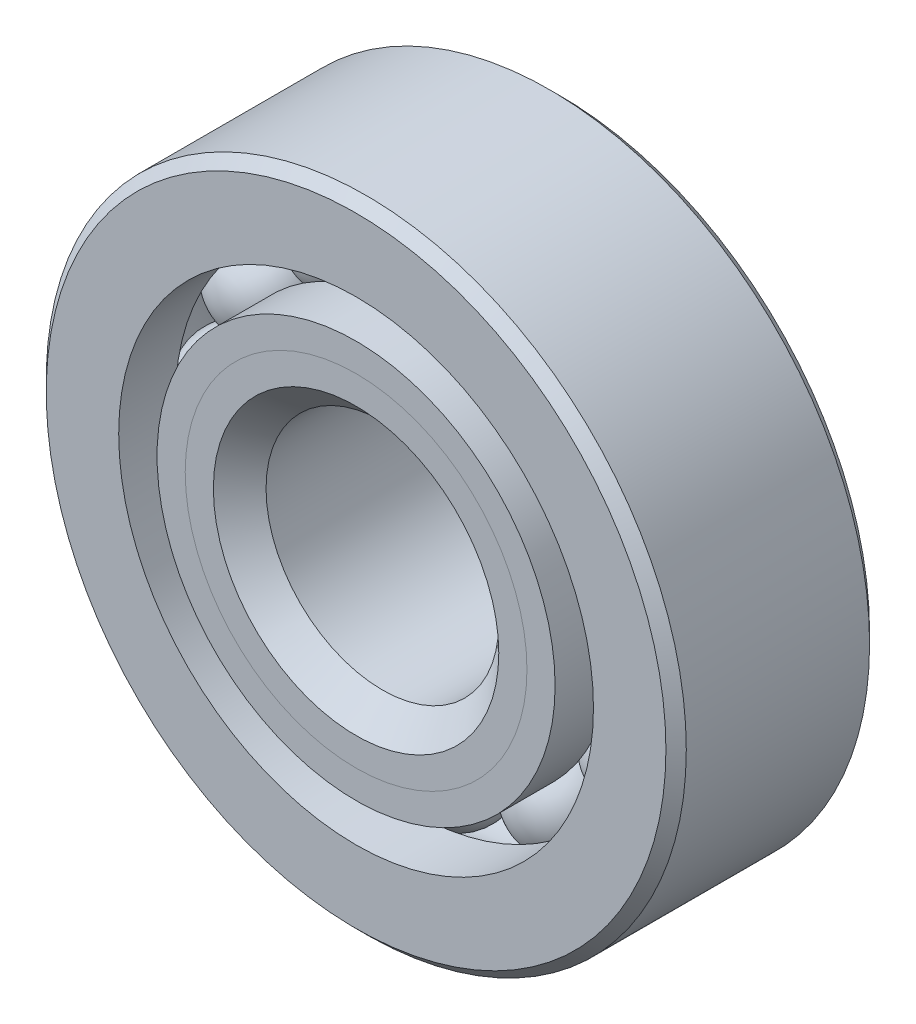
ISO-10303-21;
HEADER;
FILE_DESCRIPTION(('STEP AP214'),'2;1');
FILE_NAME('part.step','',(''),(''),'','','');
FILE_SCHEMA(('AUTOMOTIVE_DESIGN { 1 0 10303 214 1 1 1 1 }'));
ENDSEC;
DATA;
#1=APPLICATION_CONTEXT('core data for automotive mechanical design processes');
#2=APPLICATION_PROTOCOL_DEFINITION('international standard','automotive_design',2000,#1);
#3=PRODUCT_CONTEXT('',#1,'mechanical');
#4=PRODUCT('Part','Part','',(#3));
#5=PRODUCT_RELATED_PRODUCT_CATEGORY('part','',(#4));
#6=PRODUCT_DEFINITION_FORMATION('','',#4);
#7=PRODUCT_DEFINITION_CONTEXT('part definition',#1,'design');
#8=PRODUCT_DEFINITION('design','',#6,#7);
#9=PRODUCT_DEFINITION_SHAPE('','',#8);
#10=(LENGTH_UNIT() NAMED_UNIT(*) SI_UNIT(.MILLI.,.METRE.));
#11=(NAMED_UNIT(*) PLANE_ANGLE_UNIT() SI_UNIT($,.RADIAN.));
#12=(NAMED_UNIT(*) SI_UNIT($,.STERADIAN.) SOLID_ANGLE_UNIT());
#13=UNCERTAINTY_MEASURE_WITH_UNIT(LENGTH_MEASURE(1.E-05),#10,'distance_accuracy_value','');
#14=(GEOMETRIC_REPRESENTATION_CONTEXT(3) GLOBAL_UNCERTAINTY_ASSIGNED_CONTEXT((#13)) GLOBAL_UNIT_ASSIGNED_CONTEXT((#10,
#11,#12)) REPRESENTATION_CONTEXT('',''));
#15=CARTESIAN_POINT('',(0.,0.,0.));
#16=DIRECTION('',(0.,0.,1.));
#17=DIRECTION('',(1.,0.,0.));
#18=AXIS2_PLACEMENT_3D('',#15,#16,#17);
#19=CARTESIAN_POINT('',(-5.95312499999987,10.3111149638085,0.));
#20=DIRECTION('',(0.,0.,1.));
#21=DIRECTION('',(-0.499999999999989,0.866025403784445,0.));
#22=AXIS2_PLACEMENT_3D('',#19,#20,#21);
#23=SPHERICAL_SURFACE('',#22,2.68211551867683);
#24=CARTESIAN_POINT('',(-5.95312499999987,10.3111149638085,2.68211551867683));
#25=VERTEX_POINT('',#24);
#26=VERTEX_LOOP('',#25);
#27=FACE_BOUND('',#26,.T.);
#28=ADVANCED_FACE('F41',(#27),#23,.T.);
#29=CLOSED_SHELL('',(#28));
#30=MANIFOLD_SOLID_BREP('B2',#29);
#31=CARTESIAN_POINT('',(-10.3111149638084,5.95312500000012,0.));
#32=DIRECTION('',(0.,0.,1.));
#33=DIRECTION('',(-0.866025403784433,0.50000000000001,0.));
#34=AXIS2_PLACEMENT_3D('',#31,#32,#33);
#35=SPHERICAL_SURFACE('',#34,2.68211551867683);
#36=CARTESIAN_POINT('',(-10.3111149638084,5.95312500000012,2.68211551867683));
#37=VERTEX_POINT('',#36);
#38=VERTEX_LOOP('',#37);
#39=FACE_BOUND('',#38,.T.);
#40=ADVANCED_FACE('F70',(#39),#35,.T.);
#41=CLOSED_SHELL('',(#40));
#42=MANIFOLD_SOLID_BREP('B6',#41);
#43=CARTESIAN_POINT('',(-11.90625,1.24711421304626E-13,0.));
#44=DIRECTION('',(0.,0.,1.));
#45=DIRECTION('',(-1.,0.,0.));
#46=AXIS2_PLACEMENT_3D('',#43,#44,#45);
#47=SPHERICAL_SURFACE('',#46,2.68211551867683);
#48=CARTESIAN_POINT('',(-11.90625,1.24711421304626E-13,2.68211551867683));
#49=VERTEX_POINT('',#48);
#50=VERTEX_LOOP('',#49);
#51=FACE_BOUND('',#50,.T.);
#52=ADVANCED_FACE('F99',(#51),#47,.T.);
#53=CLOSED_SHELL('',(#52));
#54=MANIFOLD_SOLID_BREP('B37',#53);
#55=CARTESIAN_POINT('',(-10.3111149638085,-5.9531249999999,0.));
#56=DIRECTION('',(0.,0.,1.));
#57=DIRECTION('',(-0.866025403784443,-0.499999999999992,0.));
#58=AXIS2_PLACEMENT_3D('',#55,#56,#57);
#59=SPHERICAL_SURFACE('',#58,2.68211551867683);
#60=CARTESIAN_POINT('',(-10.3111149638085,-5.9531249999999,2.68211551867683));
#61=VERTEX_POINT('',#60);
#62=VERTEX_LOOP('',#61);
#63=FACE_BOUND('',#62,.T.);
#64=ADVANCED_FACE('F128',(#63),#59,.T.);
#65=CLOSED_SHELL('',(#64));
#66=MANIFOLD_SOLID_BREP('B66',#65);
#67=CARTESIAN_POINT('',(-5.95312500000009,-10.3111149638084,0.));
#68=DIRECTION('',(0.,0.,1.));
#69=DIRECTION('',(-0.500000000000007,-0.866025403784435,0.));
#70=AXIS2_PLACEMENT_3D('',#67,#68,#69);
#71=SPHERICAL_SURFACE('',#70,2.68211551867683);
#72=CARTESIAN_POINT('',(-5.95312500000009,-10.3111149638084,2.68211551867683));
#73=VERTEX_POINT('',#72);
#74=VERTEX_LOOP('',#73);
#75=FACE_BOUND('',#74,.T.);
#76=ADVANCED_FACE('F157',(#75),#71,.T.);
#77=CLOSED_SHELL('',(#76));
#78=MANIFOLD_SOLID_BREP('B95',#77);
#79=CARTESIAN_POINT('',(0.,-11.90625,0.));
#80=DIRECTION('',(0.,0.,1.));
#81=DIRECTION('',(0.,-1.,0.));
#82=AXIS2_PLACEMENT_3D('',#79,#80,#81);
#83=SPHERICAL_SURFACE('',#82,2.68211551867683);
#84=CARTESIAN_POINT('',(0.,-11.90625,2.68211551867683));
#85=VERTEX_POINT('',#84);
#86=VERTEX_LOOP('',#85);
#87=FACE_BOUND('',#86,.T.);
#88=ADVANCED_FACE('F186',(#87),#83,.T.);
#89=CLOSED_SHELL('',(#88));
#90=MANIFOLD_SOLID_BREP('B124',#89);
#91=CARTESIAN_POINT('',(5.95312499999994,-10.3111149638085,0.));
#92=DIRECTION('',(0.,0.,1.));
#93=DIRECTION('',(0.499999999999995,-0.866025403784442,0.));
#94=AXIS2_PLACEMENT_3D('',#91,#92,#93);
#95=SPHERICAL_SURFACE('',#94,2.68211551867683);
#96=CARTESIAN_POINT('',(5.95312499999994,-10.3111149638085,2.68211551867683));
#97=VERTEX_POINT('',#96);
#98=VERTEX_LOOP('',#97);
#99=FACE_BOUND('',#98,.T.);
#100=ADVANCED_FACE('F215',(#99),#95,.T.);
#101=CLOSED_SHELL('',(#100));
#102=MANIFOLD_SOLID_BREP('B153',#101);
#103=CARTESIAN_POINT('',(10.3111149638084,-5.95312500000005,0.));
#104=DIRECTION('',(0.,0.,1.));
#105=DIRECTION('',(0.866025403784436,-0.500000000000004,0.));
#106=AXIS2_PLACEMENT_3D('',#103,#104,#105);
#107=SPHERICAL_SURFACE('',#106,2.68211551867683);
#108=CARTESIAN_POINT('',(10.3111149638084,-5.95312500000005,2.68211551867683));
#109=VERTEX_POINT('',#108);
#110=VERTEX_LOOP('',#109);
#111=FACE_BOUND('',#110,.T.);
#112=ADVANCED_FACE('F244',(#111),#107,.T.);
#113=CLOSED_SHELL('',(#112));
#114=MANIFOLD_SOLID_BREP('B182',#113);
#115=CARTESIAN_POINT('',(11.90625,0.,0.));
#116=DIRECTION('',(0.,0.,1.));
#117=DIRECTION('',(1.,0.,0.));
#118=AXIS2_PLACEMENT_3D('',#115,#116,#117);
#119=SPHERICAL_SURFACE('',#118,2.68211551867683);
#120=CARTESIAN_POINT('',(11.90625,0.,2.68211551867683));
#121=VERTEX_POINT('',#120);
#122=VERTEX_LOOP('',#121);
#123=FACE_BOUND('',#122,.T.);
#124=ADVANCED_FACE('F273',(#123),#119,.T.);
#125=CLOSED_SHELL('',(#124));
#126=MANIFOLD_SOLID_BREP('B211',#125);
#127=CARTESIAN_POINT('',(10.3111149638085,5.95312499999998,0.));
#128=DIRECTION('',(0.,0.,1.));
#129=DIRECTION('',(0.86602540378444,0.499999999999998,0.));
#130=AXIS2_PLACEMENT_3D('',#127,#128,#129);
#131=SPHERICAL_SURFACE('',#130,2.68211551867683);
#132=CARTESIAN_POINT('',(10.3111149638085,5.95312499999998,2.68211551867683));
#133=VERTEX_POINT('',#132);
#134=VERTEX_LOOP('',#133);
#135=FACE_BOUND('',#134,.T.);
#136=ADVANCED_FACE('F302',(#135),#131,.T.);
#137=CLOSED_SHELL('',(#136));
#138=MANIFOLD_SOLID_BREP('B240',#137);
#139=CARTESIAN_POINT('',(5.95312500000001,10.3111149638085,0.));
#140=DIRECTION('',(0.,0.,1.));
#141=DIRECTION('',(0.500000000000001,0.866025403784438,0.));
#142=AXIS2_PLACEMENT_3D('',#139,#140,#141);
#143=SPHERICAL_SURFACE('',#142,2.68211551867683);
#144=CARTESIAN_POINT('',(5.95312500000001,10.3111149638085,2.68211551867683));
#145=VERTEX_POINT('',#144);
#146=VERTEX_LOOP('',#145);
#147=FACE_BOUND('',#146,.T.);
#148=ADVANCED_FACE('F331',(#147),#143,.T.);
#149=CLOSED_SHELL('',(#148));
#150=MANIFOLD_SOLID_BREP('B269',#149);
#151=CARTESIAN_POINT('',(0.,11.90625,0.));
#152=DIRECTION('',(0.,0.,1.));
#153=DIRECTION('',(0.,1.,0.));
#154=AXIS2_PLACEMENT_3D('',#151,#152,#153);
#155=SPHERICAL_SURFACE('',#154,2.68211551867683);
#156=CARTESIAN_POINT('',(0.,11.90625,2.68211551867683));
#157=VERTEX_POINT('',#156);
#158=VERTEX_LOOP('',#157);
#159=FACE_BOUND('',#158,.T.);
#160=ADVANCED_FACE('F362',(#159),#155,.T.);
#161=CLOSED_SHELL('',(#160));
#162=MANIFOLD_SOLID_BREP('B298',#161);
#163=CARTESIAN_POINT('',(0.,9.32330697197915,5.55625));
#164=DIRECTION('',(0.,0.,-1.));
#165=DIRECTION('',(-1.,0.,0.));
#166=AXIS2_PLACEMENT_3D('',#163,#164,#165);
#167=PLANE('',#166);
#168=CARTESIAN_POINT('',(0.,0.,5.55625));
#169=DIRECTION('',(0.,0.,1.));
#170=DIRECTION('',(1.,0.,0.));
#171=AXIS2_PLACEMENT_3D('',#168,#169,#170);
#172=CIRCLE('',#171,7.78706724066159);
#173=CARTESIAN_POINT('',(7.78706724066159,0.,5.55625));
#174=VERTEX_POINT('',#173);
#175=EDGE_CURVE('E416',#174,#174,#172,.T.);
#176=ORIENTED_EDGE('',*,*,#175,.F.);
#177=EDGE_LOOP('',(#176));
#178=FACE_BOUND('',#177,.T.);
#179=CARTESIAN_POINT('',(0.,0.,5.55625));
#180=DIRECTION('',(0.,0.,1.));
#181=DIRECTION('',(1.,0.,0.));
#182=AXIS2_PLACEMENT_3D('',#179,#180,#181);
#183=CIRCLE('',#182,9.32330697197915);
#184=CARTESIAN_POINT('',(9.32330697197915,0.,5.55625));
#185=VERTEX_POINT('',#184);
#186=EDGE_CURVE('E361',#185,#185,#183,.T.);
#187=ORIENTED_EDGE('',*,*,#186,.T.);
#188=EDGE_LOOP('',(#187));
#189=FACE_BOUND('',#188,.T.);
#190=ADVANCED_FACE('F382',(#178,#189),#167,.F.);
#191=CARTESIAN_POINT('',(0.,0.,4.02001026868245));
#192=DIRECTION('',(0.,0.,1.));
#193=DIRECTION('',(1.,0.,0.));
#194=AXIS2_PLACEMENT_3D('',#191,#192,#193);
#195=CONICAL_SURFACE('',#194,7.78706724066159,0.785398163397451);
#196=ORIENTED_EDGE('',*,*,#186,.F.);
#197=EDGE_LOOP('',(#196));
#198=FACE_BOUND('',#197,.T.);
#199=CARTESIAN_POINT('',(0.,0.,4.02001026868245));
#200=DIRECTION('',(0.,0.,1.));
#201=DIRECTION('',(1.,0.,0.));
#202=AXIS2_PLACEMENT_3D('',#199,#200,#201);
#203=CIRCLE('',#202,7.78706724066159);
#204=CARTESIAN_POINT('',(7.78706724066159,0.,4.02001026868245));
#205=VERTEX_POINT('',#204);
#206=EDGE_CURVE('E388',#205,#205,#203,.T.);
#207=ORIENTED_EDGE('',*,*,#206,.T.);
#208=EDGE_LOOP('',(#207));
#209=FACE_BOUND('',#208,.T.);
#210=ADVANCED_FACE('F423',(#198,#209),#195,.T.);
#211=CARTESIAN_POINT('',(0.,0.,5.55625));
#212=DIRECTION('',(0.,0.,1.));
#213=DIRECTION('',(1.,0.,0.));
#214=AXIS2_PLACEMENT_3D('',#211,#212,#213);
#215=CYLINDRICAL_SURFACE('',#214,7.78706724066159);
#216=ORIENTED_EDGE('',*,*,#206,.F.);
#217=EDGE_LOOP('',(#216));
#218=FACE_BOUND('',#217,.T.);
#219=CARTESIAN_POINT('',(0.,0.,0.));
#220=DIRECTION('',(0.,0.,1.));
#221=DIRECTION('',(1.,0.,0.));
#222=AXIS2_PLACEMENT_3D('',#219,#220,#221);
#223=CIRCLE('',#222,7.78706724066159);
#224=CARTESIAN_POINT('',(7.78706724066159,0.,0.));
#225=VERTEX_POINT('',#224);
#226=EDGE_CURVE('E392',#225,#225,#223,.T.);
#227=ORIENTED_EDGE('',*,*,#226,.T.);
#228=EDGE_LOOP('',(#227));
#229=FACE_BOUND('',#228,.T.);
#230=ADVANCED_FACE('F427',(#218,#229),#215,.T.);
#231=CARTESIAN_POINT('',(0.,7.78706724066159,0.));
#232=DIRECTION('',(0.,0.,-1.));
#233=DIRECTION('',(-1.,0.,0.));
#234=AXIS2_PLACEMENT_3D('',#231,#232,#233);
#235=PLANE('',#234);
#236=ORIENTED_EDGE('',*,*,#226,.F.);
#237=EDGE_LOOP('',(#236));
#238=FACE_BOUND('',#237,.T.);
#239=CARTESIAN_POINT('',(0.,0.,0.));
#240=DIRECTION('',(0.,0.,1.));
#241=DIRECTION('',(1.,0.,0.));
#242=AXIS2_PLACEMENT_3D('',#239,#240,#241);
#243=CIRCLE('',#242,9.22413448132317);
#244=CARTESIAN_POINT('',(9.22413448132317,0.,0.));
#245=VERTEX_POINT('',#244);
#246=EDGE_CURVE('E396',#245,#245,#243,.T.);
#247=ORIENTED_EDGE('',*,*,#246,.T.);
#248=EDGE_LOOP('',(#247));
#249=FACE_BOUND('',#248,.T.);
#250=ADVANCED_FACE('F432',(#238,#249),#235,.F.);
#251=CARTESIAN_POINT('',(0.,0.,0.));
#252=DIRECTION('',(0.,0.,1.));
#253=DIRECTION('',(1.,0.,0.));
#254=AXIS2_PLACEMENT_3D('',#251,#252,#253);
#255=TOROIDAL_SURFACE('',#254,11.90625,2.68211551867683);
#256=ORIENTED_EDGE('',*,*,#246,.F.);
#257=EDGE_LOOP('',(#256));
#258=FACE_BOUND('',#257,.T.);
#259=CARTESIAN_POINT('',(0.,0.,-2.46944444444444));
#260=DIRECTION('',(0.,0.,1.));
#261=DIRECTION('',(1.,0.,0.));
#262=AXIS2_PLACEMENT_3D('',#259,#260,#261);
#263=CIRCLE('',#262,10.8595467032967);
#264=CARTESIAN_POINT('',(10.8595467032967,0.,-2.46944444444444));
#265=VERTEX_POINT('',#264);
#266=EDGE_CURVE('E401',#265,#265,#263,.T.);
#267=ORIENTED_EDGE('',*,*,#266,.T.);
#268=EDGE_LOOP('',(#267));
#269=FACE_BOUND('',#268,.T.);
#270=ADVANCED_FACE('F438',(#258,#269),#255,.F.);
#271=CARTESIAN_POINT('',(0.,0.,5.55625));
#272=DIRECTION('',(0.,0.,1.));
#273=DIRECTION('',(1.,0.,0.));
#274=AXIS2_PLACEMENT_3D('',#271,#272,#273);
#275=CYLINDRICAL_SURFACE('',#274,10.8595467032967);
#276=ORIENTED_EDGE('',*,*,#266,.F.);
#277=EDGE_LOOP('',(#276));
#278=FACE_BOUND('',#277,.T.);
#279=CARTESIAN_POINT('',(0.,0.,-5.55625));
#280=DIRECTION('',(0.,0.,1.));
#281=DIRECTION('',(1.,0.,0.));
#282=AXIS2_PLACEMENT_3D('',#279,#280,#281);
#283=CIRCLE('',#282,10.8595467032967);
#284=CARTESIAN_POINT('',(10.8595467032967,0.,-5.55625));
#285=VERTEX_POINT('',#284);
#286=EDGE_CURVE('E404',#285,#285,#283,.T.);
#287=ORIENTED_EDGE('',*,*,#286,.T.);
#288=EDGE_LOOP('',(#287));
#289=FACE_BOUND('',#288,.T.);
#290=ADVANCED_FACE('F442',(#278,#289),#275,.T.);
#291=CARTESIAN_POINT('',(0.,6.905625,-5.55625));
#292=DIRECTION('',(0.,0.,1.));
#293=DIRECTION('',(1.,0.,0.));
#294=AXIS2_PLACEMENT_3D('',#291,#292,#293);
#295=PLANE('',#294);
#296=ORIENTED_EDGE('',*,*,#286,.F.);
#297=EDGE_LOOP('',(#296));
#298=FACE_BOUND('',#297,.T.);
#299=CARTESIAN_POINT('',(0.,0.,-5.55625));
#300=DIRECTION('',(0.,0.,1.));
#301=DIRECTION('',(1.,0.,0.));
#302=AXIS2_PLACEMENT_3D('',#299,#300,#301);
#303=CIRCLE('',#302,6.905625);
#304=CARTESIAN_POINT('',(6.905625,0.,-5.55625));
#305=VERTEX_POINT('',#304);
#306=EDGE_CURVE('E407',#305,#305,#303,.T.);
#307=ORIENTED_EDGE('',*,*,#306,.T.);
#308=EDGE_LOOP('',(#307));
#309=FACE_BOUND('',#308,.T.);
#310=ADVANCED_FACE('F446',(#298,#309),#295,.F.);
#311=CARTESIAN_POINT('',(0.,0.,-5.000625));
#312=DIRECTION('',(0.,0.,-1.));
#313=DIRECTION('',(-1.,0.,0.));
#314=AXIS2_PLACEMENT_3D('',#311,#312,#313);
#315=CONICAL_SURFACE('',#314,6.35,0.78539816339745);
#316=ORIENTED_EDGE('',*,*,#306,.F.);
#317=EDGE_LOOP('',(#316));
#318=FACE_BOUND('',#317,.T.);
#319=CARTESIAN_POINT('',(0.,0.,-5.000625));
#320=DIRECTION('',(0.,0.,1.));
#321=DIRECTION('',(1.,0.,0.));
#322=AXIS2_PLACEMENT_3D('',#319,#320,#321);
#323=CIRCLE('',#322,6.35);
#324=CARTESIAN_POINT('',(6.35,0.,-5.000625));
#325=VERTEX_POINT('',#324);
#326=EDGE_CURVE('E410',#325,#325,#323,.T.);
#327=ORIENTED_EDGE('',*,*,#326,.T.);
#328=EDGE_LOOP('',(#327));
#329=FACE_BOUND('',#328,.T.);
#330=ADVANCED_FACE('F450',(#318,#329),#315,.F.);
#331=CARTESIAN_POINT('',(0.,0.,5.55625));
#332=DIRECTION('',(0.,0.,1.));
#333=DIRECTION('',(1.,0.,0.));
#334=AXIS2_PLACEMENT_3D('',#331,#332,#333);
#335=CYLINDRICAL_SURFACE('',#334,6.35);
#336=ORIENTED_EDGE('',*,*,#326,.F.);
#337=EDGE_LOOP('',(#336));
#338=FACE_BOUND('',#337,.T.);
#339=CARTESIAN_POINT('',(0.,0.,4.11918275933842));
#340=DIRECTION('',(0.,0.,1.));
#341=DIRECTION('',(1.,0.,0.));
#342=AXIS2_PLACEMENT_3D('',#339,#340,#341);
#343=CIRCLE('',#342,6.35);
#344=CARTESIAN_POINT('',(6.35,0.,4.11918275933842));
#345=VERTEX_POINT('',#344);
#346=EDGE_CURVE('E413',#345,#345,#343,.T.);
#347=ORIENTED_EDGE('',*,*,#346,.T.);
#348=EDGE_LOOP('',(#347));
#349=FACE_BOUND('',#348,.T.);
#350=ADVANCED_FACE('F454',(#338,#349),#335,.F.);
#351=CARTESIAN_POINT('',(0.,0.,5.55625));
#352=DIRECTION('',(0.,0.,1.));
#353=DIRECTION('',(1.,0.,0.));
#354=AXIS2_PLACEMENT_3D('',#351,#352,#353);
#355=CONICAL_SURFACE('',#354,7.78706724066159,0.78539816339745);
#356=ORIENTED_EDGE('',*,*,#346,.F.);
#357=EDGE_LOOP('',(#356));
#358=FACE_BOUND('',#357,.T.);
#359=ORIENTED_EDGE('',*,*,#175,.T.);
#360=EDGE_LOOP('',(#359));
#361=FACE_BOUND('',#360,.T.);
#362=ADVANCED_FACE('F420',(#358,#361),#355,.F.);
#363=CLOSED_SHELL('',(#190,#210,#230,#250,#270,#290,#310,#330,#350,#362));
#364=MANIFOLD_SOLID_BREP('B327',#363);
#365=CARTESIAN_POINT('',(0.,10.8595467032967,5.55625));
#366=DIRECTION('',(0.,0.,-1.));
#367=DIRECTION('',(-1.,0.,0.));
#368=AXIS2_PLACEMENT_3D('',#365,#366,#367);
#369=PLANE('',#368);
#370=CARTESIAN_POINT('',(0.,0.,5.55625));
#371=DIRECTION('',(0.,0.,1.));
#372=DIRECTION('',(1.,0.,0.));
#373=AXIS2_PLACEMENT_3D('',#370,#371,#372);
#374=CIRCLE('',#373,9.32330697197915);
#375=CARTESIAN_POINT('',(9.32330697197915,0.,5.55625));
#376=VERTEX_POINT('',#375);
#377=EDGE_CURVE('E381',#376,#376,#374,.T.);
#378=ORIENTED_EDGE('',*,*,#377,.F.);
#379=EDGE_LOOP('',(#378));
#380=FACE_BOUND('',#379,.T.);
#381=CARTESIAN_POINT('',(0.,0.,5.55625));
#382=DIRECTION('',(0.,0.,1.));
#383=DIRECTION('',(1.,0.,0.));
#384=AXIS2_PLACEMENT_3D('',#381,#382,#383);
#385=CIRCLE('',#384,10.8595467032967);
#386=CARTESIAN_POINT('',(10.8595467032967,0.,5.55625));
#387=VERTEX_POINT('',#386);
#388=EDGE_CURVE('E562',#387,#387,#385,.T.);
#389=ORIENTED_EDGE('',*,*,#388,.T.);
#390=EDGE_LOOP('',(#389));
#391=FACE_BOUND('',#390,.T.);
#392=ADVANCED_FACE('F540',(#380,#391),#369,.F.);
#393=CARTESIAN_POINT('',(0.,0.,5.55625));
#394=DIRECTION('',(0.,0.,1.));
#395=DIRECTION('',(1.,0.,0.));
#396=AXIS2_PLACEMENT_3D('',#393,#394,#395);
#397=CONICAL_SURFACE('',#396,9.32330697197915,0.785398163397451);
#398=CARTESIAN_POINT('',(0.,0.,4.02001026868245));
#399=DIRECTION('',(0.,0.,1.));
#400=DIRECTION('',(1.,0.,0.));
#401=AXIS2_PLACEMENT_3D('',#398,#399,#400);
#402=CIRCLE('',#401,7.78706724066159);
#403=CARTESIAN_POINT('',(7.78706724066159,0.,4.02001026868245));
#404=VERTEX_POINT('',#403);
#405=EDGE_CURVE('E546',#404,#404,#402,.T.);
#406=ORIENTED_EDGE('',*,*,#405,.F.);
#407=EDGE_LOOP('',(#406));
#408=FACE_BOUND('',#407,.T.);
#409=ORIENTED_EDGE('',*,*,#377,.T.);
#410=EDGE_LOOP('',(#409));
#411=FACE_BOUND('',#410,.T.);
#412=ADVANCED_FACE('F587',(#408,#411),#397,.F.);
#413=CARTESIAN_POINT('',(0.,0.,5.55625));
#414=DIRECTION('',(0.,0.,1.));
#415=DIRECTION('',(1.,0.,0.));
#416=AXIS2_PLACEMENT_3D('',#413,#414,#415);
#417=CYLINDRICAL_SURFACE('',#416,7.78706724066159);
#418=CARTESIAN_POINT('',(0.,0.,0.));
#419=DIRECTION('',(0.,0.,1.));
#420=DIRECTION('',(1.,0.,0.));
#421=AXIS2_PLACEMENT_3D('',#418,#419,#420);
#422=CIRCLE('',#421,7.78706724066159);
#423=CARTESIAN_POINT('',(7.78706724066159,0.,0.));
#424=VERTEX_POINT('',#423);
#425=EDGE_CURVE('E550',#424,#424,#422,.T.);
#426=ORIENTED_EDGE('',*,*,#425,.F.);
#427=EDGE_LOOP('',(#426));
#428=FACE_BOUND('',#427,.T.);
#429=ORIENTED_EDGE('',*,*,#405,.T.);
#430=EDGE_LOOP('',(#429));
#431=FACE_BOUND('',#430,.T.);
#432=ADVANCED_FACE('F582',(#428,#431),#417,.F.);
#433=CARTESIAN_POINT('',(0.,7.78706724066159,0.));
#434=DIRECTION('',(0.,0.,1.));
#435=DIRECTION('',(1.,0.,0.));
#436=AXIS2_PLACEMENT_3D('',#433,#434,#435);
#437=PLANE('',#436);
#438=CARTESIAN_POINT('',(0.,0.,0.));
#439=DIRECTION('',(0.,0.,1.));
#440=DIRECTION('',(1.,0.,0.));
#441=AXIS2_PLACEMENT_3D('',#438,#439,#440);
#442=CIRCLE('',#441,9.22413448132317);
#443=CARTESIAN_POINT('',(9.22413448132317,0.,0.));
#444=VERTEX_POINT('',#443);
#445=EDGE_CURVE('E554',#444,#444,#442,.T.);
#446=ORIENTED_EDGE('',*,*,#445,.F.);
#447=EDGE_LOOP('',(#446));
#448=FACE_BOUND('',#447,.T.);
#449=ORIENTED_EDGE('',*,*,#425,.T.);
#450=EDGE_LOOP('',(#449));
#451=FACE_BOUND('',#450,.T.);
#452=ADVANCED_FACE('F576',(#448,#451),#437,.F.);
#453=CARTESIAN_POINT('',(0.,0.,0.));
#454=DIRECTION('',(0.,0.,1.));
#455=DIRECTION('',(1.,0.,0.));
#456=AXIS2_PLACEMENT_3D('',#453,#454,#455);
#457=TOROIDAL_SURFACE('',#456,11.90625,2.68211551867683);
#458=CARTESIAN_POINT('',(0.,0.,2.46944444444444));
#459=DIRECTION('',(0.,0.,1.));
#460=DIRECTION('',(1.,0.,0.));
#461=AXIS2_PLACEMENT_3D('',#458,#459,#460);
#462=CIRCLE('',#461,10.8595467032967);
#463=CARTESIAN_POINT('',(10.8595467032967,0.,2.46944444444444));
#464=VERTEX_POINT('',#463);
#465=EDGE_CURVE('E559',#464,#464,#462,.T.);
#466=ORIENTED_EDGE('',*,*,#465,.F.);
#467=EDGE_LOOP('',(#466));
#468=FACE_BOUND('',#467,.T.);
#469=ORIENTED_EDGE('',*,*,#445,.T.);
#470=EDGE_LOOP('',(#469));
#471=FACE_BOUND('',#470,.T.);
#472=ADVANCED_FACE('F570',(#468,#471),#457,.F.);
#473=CARTESIAN_POINT('',(0.,0.,5.55625));
#474=DIRECTION('',(0.,0.,1.));
#475=DIRECTION('',(1.,0.,0.));
#476=AXIS2_PLACEMENT_3D('',#473,#474,#475);
#477=CYLINDRICAL_SURFACE('',#476,10.8595467032967);
#478=ORIENTED_EDGE('',*,*,#388,.F.);
#479=EDGE_LOOP('',(#478));
#480=FACE_BOUND('',#479,.T.);
#481=ORIENTED_EDGE('',*,*,#465,.T.);
#482=EDGE_LOOP('',(#481));
#483=FACE_BOUND('',#482,.T.);
#484=ADVANCED_FACE('F567',(#480,#483),#477,.T.);
#485=CLOSED_SHELL('',(#392,#412,#432,#452,#472,#484));
#486=MANIFOLD_SOLID_BREP('B356',#485);
#487=CARTESIAN_POINT('',(0.,0.,5.000625));
#488=DIRECTION('',(0.,0.,-1.));
#489=DIRECTION('',(-1.,0.,0.));
#490=AXIS2_PLACEMENT_3D('',#487,#488,#489);
#491=CONICAL_SURFACE('',#490,17.4625,0.785398163397446);
#492=CARTESIAN_POINT('',(0.,0.,5.55625));
#493=DIRECTION('',(0.,0.,1.));
#494=DIRECTION('',(1.,0.,0.));
#495=AXIS2_PLACEMENT_3D('',#492,#493,#494);
#496=CIRCLE('',#495,16.906875);
#497=CARTESIAN_POINT('',(16.906875,0.,5.55625));
#498=VERTEX_POINT('',#497);
#499=EDGE_CURVE('E659',#498,#498,#496,.T.);
#500=ORIENTED_EDGE('',*,*,#499,.F.);
#501=EDGE_LOOP('',(#500));
#502=FACE_BOUND('',#501,.T.);
#503=CARTESIAN_POINT('',(0.,0.,5.000625));
#504=DIRECTION('',(0.,0.,1.));
#505=DIRECTION('',(1.,0.,0.));
#506=AXIS2_PLACEMENT_3D('',#503,#504,#505);
#507=CIRCLE('',#506,17.4625);
#508=CARTESIAN_POINT('',(17.4625,0.,5.000625));
#509=VERTEX_POINT('',#508);
#510=EDGE_CURVE('E539',#509,#509,#507,.T.);
#511=ORIENTED_EDGE('',*,*,#510,.T.);
#512=EDGE_LOOP('',(#511));
#513=FACE_BOUND('',#512,.T.);
#514=ADVANCED_FACE('F631',(#502,#513),#491,.T.);
#515=CARTESIAN_POINT('',(0.,0.,5.55625));
#516=DIRECTION('',(0.,0.,1.));
#517=DIRECTION('',(1.,0.,0.));
#518=AXIS2_PLACEMENT_3D('',#515,#516,#517);
#519=CYLINDRICAL_SURFACE('',#518,17.4625);
#520=ORIENTED_EDGE('',*,*,#510,.F.);
#521=EDGE_LOOP('',(#520));
#522=FACE_BOUND('',#521,.T.);
#523=CARTESIAN_POINT('',(0.,0.,-5.000625));
#524=DIRECTION('',(0.,0.,1.));
#525=DIRECTION('',(1.,0.,0.));
#526=AXIS2_PLACEMENT_3D('',#523,#524,#525);
#527=CIRCLE('',#526,17.4625);
#528=CARTESIAN_POINT('',(17.4625,0.,-5.000625));
#529=VERTEX_POINT('',#528);
#530=EDGE_CURVE('E637',#529,#529,#527,.T.);
#531=ORIENTED_EDGE('',*,*,#530,.T.);
#532=EDGE_LOOP('',(#531));
#533=FACE_BOUND('',#532,.T.);
#534=ADVANCED_FACE('F666',(#522,#533),#519,.T.);
#535=CARTESIAN_POINT('',(0.,0.,-5.55625));
#536=DIRECTION('',(0.,0.,1.));
#537=DIRECTION('',(1.,0.,0.));
#538=AXIS2_PLACEMENT_3D('',#535,#536,#537);
#539=CONICAL_SURFACE('',#538,16.906875,0.785398163397447);
#540=ORIENTED_EDGE('',*,*,#530,.F.);
#541=EDGE_LOOP('',(#540));
#542=FACE_BOUND('',#541,.T.);
#543=CARTESIAN_POINT('',(0.,0.,-5.55625));
#544=DIRECTION('',(0.,0.,1.));
#545=DIRECTION('',(1.,0.,0.));
#546=AXIS2_PLACEMENT_3D('',#543,#544,#545);
#547=CIRCLE('',#546,16.906875);
#548=CARTESIAN_POINT('',(16.906875,0.,-5.55625));
#549=VERTEX_POINT('',#548);
#550=EDGE_CURVE('E641',#549,#549,#547,.T.);
#551=ORIENTED_EDGE('',*,*,#550,.T.);
#552=EDGE_LOOP('',(#551));
#553=FACE_BOUND('',#552,.T.);
#554=ADVANCED_FACE('F670',(#542,#553),#539,.T.);
#555=CARTESIAN_POINT('',(0.,16.906875,-5.55625));
#556=DIRECTION('',(0.,0.,1.));
#557=DIRECTION('',(1.,0.,0.));
#558=AXIS2_PLACEMENT_3D('',#555,#556,#557);
#559=PLANE('',#558);
#560=ORIENTED_EDGE('',*,*,#550,.F.);
#561=EDGE_LOOP('',(#560));
#562=FACE_BOUND('',#561,.T.);
#563=CARTESIAN_POINT('',(0.,0.,-5.55625));
#564=DIRECTION('',(0.,0.,1.));
#565=DIRECTION('',(1.,0.,0.));
#566=AXIS2_PLACEMENT_3D('',#563,#564,#565);
#567=CIRCLE('',#566,12.9529532967033);
#568=CARTESIAN_POINT('',(12.9529532967033,0.,-5.55625));
#569=VERTEX_POINT('',#568);
#570=EDGE_CURVE('E645',#569,#569,#567,.T.);
#571=ORIENTED_EDGE('',*,*,#570,.T.);
#572=EDGE_LOOP('',(#571));
#573=FACE_BOUND('',#572,.T.);
#574=ADVANCED_FACE('F675',(#562,#573),#559,.F.);
#575=CARTESIAN_POINT('',(0.,0.,5.55625));
#576=DIRECTION('',(0.,0.,1.));
#577=DIRECTION('',(1.,0.,0.));
#578=AXIS2_PLACEMENT_3D('',#575,#576,#577);
#579=CYLINDRICAL_SURFACE('',#578,12.9529532967033);
#580=ORIENTED_EDGE('',*,*,#570,.F.);
#581=EDGE_LOOP('',(#580));
#582=FACE_BOUND('',#581,.T.);
#583=CARTESIAN_POINT('',(0.,0.,-2.46944444444445));
#584=DIRECTION('',(0.,0.,1.));
#585=DIRECTION('',(1.,0.,0.));
#586=AXIS2_PLACEMENT_3D('',#583,#584,#585);
#587=CIRCLE('',#586,12.9529532967033);
#588=CARTESIAN_POINT('',(12.9529532967033,0.,-2.46944444444445));
#589=VERTEX_POINT('',#588);
#590=EDGE_CURVE('E650',#589,#589,#587,.T.);
#591=ORIENTED_EDGE('',*,*,#590,.T.);
#592=EDGE_LOOP('',(#591));
#593=FACE_BOUND('',#592,.T.);
#594=ADVANCED_FACE('F681',(#582,#593),#579,.F.);
#595=CARTESIAN_POINT('',(0.,0.,0.));
#596=DIRECTION('',(0.,0.,1.));
#597=DIRECTION('',(1.,0.,0.));
#598=AXIS2_PLACEMENT_3D('',#595,#596,#597);
#599=TOROIDAL_SURFACE('',#598,11.90625,2.68211551867683);
#600=ORIENTED_EDGE('',*,*,#590,.F.);
#601=EDGE_LOOP('',(#600));
#602=FACE_BOUND('',#601,.T.);
#603=CARTESIAN_POINT('',(0.,0.,2.46944444444444));
#604=DIRECTION('',(0.,0.,1.));
#605=DIRECTION('',(1.,0.,0.));
#606=AXIS2_PLACEMENT_3D('',#603,#604,#605);
#607=CIRCLE('',#606,12.9529532967033);
#608=CARTESIAN_POINT('',(12.9529532967033,0.,2.46944444444444));
#609=VERTEX_POINT('',#608);
#610=EDGE_CURVE('E653',#609,#609,#607,.T.);
#611=ORIENTED_EDGE('',*,*,#610,.T.);
#612=EDGE_LOOP('',(#611));
#613=FACE_BOUND('',#612,.T.);
#614=ADVANCED_FACE('F685',(#602,#613),#599,.F.);
#615=CARTESIAN_POINT('',(0.,0.,5.55625));
#616=DIRECTION('',(0.,0.,1.));
#617=DIRECTION('',(1.,0.,0.));
#618=AXIS2_PLACEMENT_3D('',#615,#616,#617);
#619=CYLINDRICAL_SURFACE('',#618,12.9529532967033);
#620=ORIENTED_EDGE('',*,*,#610,.F.);
#621=EDGE_LOOP('',(#620));
#622=FACE_BOUND('',#621,.T.);
#623=CARTESIAN_POINT('',(0.,0.,5.55625));
#624=DIRECTION('',(0.,0.,1.));
#625=DIRECTION('',(1.,0.,0.));
#626=AXIS2_PLACEMENT_3D('',#623,#624,#625);
#627=CIRCLE('',#626,12.9529532967033);
#628=CARTESIAN_POINT('',(12.9529532967033,0.,5.55625));
#629=VERTEX_POINT('',#628);
#630=EDGE_CURVE('E656',#629,#629,#627,.T.);
#631=ORIENTED_EDGE('',*,*,#630,.T.);
#632=EDGE_LOOP('',(#631));
#633=FACE_BOUND('',#632,.T.);
#634=ADVANCED_FACE('F689',(#622,#633),#619,.F.);
#635=CARTESIAN_POINT('',(0.,16.906875,5.55625));
#636=DIRECTION('',(0.,0.,-1.));
#637=DIRECTION('',(-1.,0.,0.));
#638=AXIS2_PLACEMENT_3D('',#635,#636,#637);
#639=PLANE('',#638);
#640=ORIENTED_EDGE('',*,*,#630,.F.);
#641=EDGE_LOOP('',(#640));
#642=FACE_BOUND('',#641,.T.);
#643=ORIENTED_EDGE('',*,*,#499,.T.);
#644=EDGE_LOOP('',(#643));
#645=FACE_BOUND('',#644,.T.);
#646=ADVANCED_FACE('F663',(#642,#645),#639,.F.);
#647=CLOSED_SHELL('',(#514,#534,#554,#574,#594,#614,#634,#646));
#648=MANIFOLD_SOLID_BREP('B376',#647);
#649=ADVANCED_BREP_SHAPE_REPRESENTATION('',(#18,#30,#42,#54,#66,#78,#90,#102,#114,#126,#138,
#150,#162,#364,#486,#648),#14);
#650=SHAPE_DEFINITION_REPRESENTATION(#9,#649);
ENDSEC;
END-ISO-10303-21;
